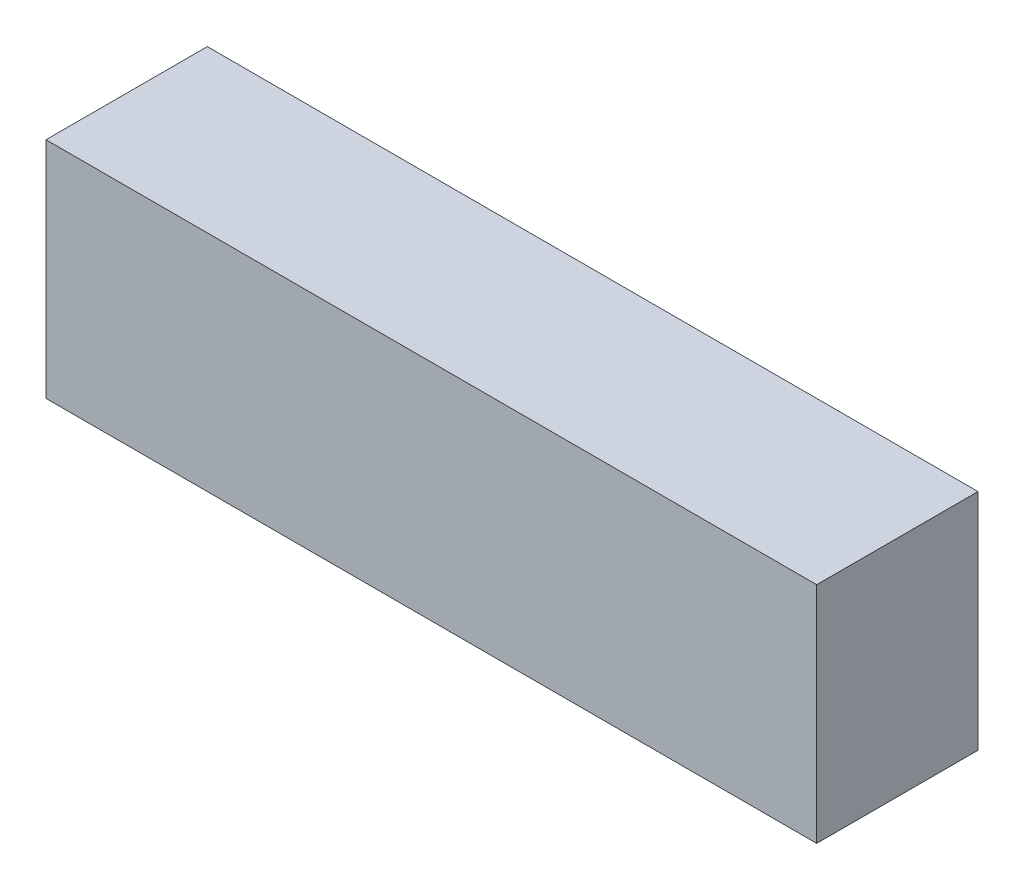
ISO-10303-21;
HEADER;
FILE_DESCRIPTION(('STEP AP214'),'2;1');
FILE_NAME('part.step','',(''),(''),'','','');
FILE_SCHEMA(('AUTOMOTIVE_DESIGN { 1 0 10303 214 1 1 1 1 }'));
ENDSEC;
DATA;
#1=APPLICATION_CONTEXT('core data for automotive mechanical design processes');
#2=APPLICATION_PROTOCOL_DEFINITION('international standard','automotive_design',2000,#1);
#3=PRODUCT_CONTEXT('',#1,'mechanical');
#4=PRODUCT('Part','Part','',(#3));
#5=PRODUCT_RELATED_PRODUCT_CATEGORY('part','',(#4));
#6=PRODUCT_DEFINITION_FORMATION('','',#4);
#7=PRODUCT_DEFINITION_CONTEXT('part definition',#1,'design');
#8=PRODUCT_DEFINITION('design','',#6,#7);
#9=PRODUCT_DEFINITION_SHAPE('','',#8);
#10=(LENGTH_UNIT() NAMED_UNIT(*) SI_UNIT(.MILLI.,.METRE.));
#11=(NAMED_UNIT(*) PLANE_ANGLE_UNIT() SI_UNIT($,.RADIAN.));
#12=(NAMED_UNIT(*) SI_UNIT($,.STERADIAN.) SOLID_ANGLE_UNIT());
#13=UNCERTAINTY_MEASURE_WITH_UNIT(LENGTH_MEASURE(1.E-05),#10,'distance_accuracy_value','');
#14=(GEOMETRIC_REPRESENTATION_CONTEXT(3) GLOBAL_UNCERTAINTY_ASSIGNED_CONTEXT((#13)) GLOBAL_UNIT_ASSIGNED_CONTEXT((#10,
#11,#12)) REPRESENTATION_CONTEXT('',''));
#15=CARTESIAN_POINT('',(0.,0.,0.));
#16=DIRECTION('',(0.,0.,1.));
#17=DIRECTION('',(1.,0.,0.));
#18=AXIS2_PLACEMENT_3D('',#15,#16,#17);
#19=CARTESIAN_POINT('',(21.5,6.25,9.));
#20=DIRECTION('',(1.,0.,0.));
#21=DIRECTION('',(0.,0.,-1.));
#22=AXIS2_PLACEMENT_3D('',#19,#20,#21);
#23=PLANE('',#22);
#24=DIRECTION('',(0.,-1.,0.));
#25=VECTOR('',#24,1.);
#26=CARTESIAN_POINT('',(21.5,6.25,0.));
#27=LINE('',#26,#25);
#28=CARTESIAN_POINT('',(21.5,6.25,0.));
#29=VERTEX_POINT('',#28);
#30=CARTESIAN_POINT('',(21.5,-6.25,0.));
#31=VERTEX_POINT('',#30);
#32=EDGE_CURVE('E100',#29,#31,#27,.T.);
#33=ORIENTED_EDGE('',*,*,#32,.F.);
#34=DIRECTION('',(0.,0.,-1.));
#35=VECTOR('',#34,1.);
#36=CARTESIAN_POINT('',(21.5,6.25,9.));
#37=LINE('',#36,#35);
#38=CARTESIAN_POINT('',(21.5,6.25,9.));
#39=VERTEX_POINT('',#38);
#40=EDGE_CURVE('E11',#39,#29,#37,.T.);
#41=ORIENTED_EDGE('',*,*,#40,.F.);
#42=DIRECTION('',(0.,-1.,0.));
#43=VECTOR('',#42,1.);
#44=CARTESIAN_POINT('',(21.5,6.25,9.));
#45=LINE('',#44,#43);
#46=CARTESIAN_POINT('',(21.5,-6.25,9.));
#47=VERTEX_POINT('',#46);
#48=EDGE_CURVE('E95',#39,#47,#45,.T.);
#49=ORIENTED_EDGE('',*,*,#48,.T.);
#50=DIRECTION('',(0.,0.,-1.));
#51=VECTOR('',#50,1.);
#52=CARTESIAN_POINT('',(21.5,-6.25,9.));
#53=LINE('',#52,#51);
#54=EDGE_CURVE('E38',#47,#31,#53,.T.);
#55=ORIENTED_EDGE('',*,*,#54,.T.);
#56=EDGE_LOOP('',(#33,#41,#49,#55));
#57=FACE_BOUND('',#56,.T.);
#58=ADVANCED_FACE('F35',(#57),#23,.T.);
#59=CARTESIAN_POINT('',(21.5,6.25,9.));
#60=DIRECTION('',(0.,-1.,0.));
#61=DIRECTION('',(1.,0.,0.));
#62=AXIS2_PLACEMENT_3D('',#59,#60,#61);
#63=PLANE('',#62);
#64=DIRECTION('',(-1.,0.,0.));
#65=VECTOR('',#64,1.);
#66=CARTESIAN_POINT('',(21.5,6.25,0.));
#67=LINE('',#66,#65);
#68=CARTESIAN_POINT('',(-21.5,6.25,0.));
#69=VERTEX_POINT('',#68);
#70=EDGE_CURVE('E68',#29,#69,#67,.T.);
#71=ORIENTED_EDGE('',*,*,#70,.T.);
#72=DIRECTION('',(0.,0.,-1.));
#73=VECTOR('',#72,1.);
#74=CARTESIAN_POINT('',(-21.5,6.25,9.));
#75=LINE('',#74,#73);
#76=CARTESIAN_POINT('',(-21.5,6.25,9.));
#77=VERTEX_POINT('',#76);
#78=EDGE_CURVE('E44',#77,#69,#75,.T.);
#79=ORIENTED_EDGE('',*,*,#78,.F.);
#80=DIRECTION('',(-1.,0.,0.));
#81=VECTOR('',#80,1.);
#82=CARTESIAN_POINT('',(21.5,6.25,9.));
#83=LINE('',#82,#81);
#84=EDGE_CURVE('E85',#39,#77,#83,.T.);
#85=ORIENTED_EDGE('',*,*,#84,.F.);
#86=ORIENTED_EDGE('',*,*,#40,.T.);
#87=EDGE_LOOP('',(#71,#79,#85,#86));
#88=FACE_BOUND('',#87,.T.);
#89=ADVANCED_FACE('F110',(#88),#63,.F.);
#90=CARTESIAN_POINT('',(-21.5,6.25,9.));
#91=DIRECTION('',(1.,0.,0.));
#92=DIRECTION('',(0.,0.,-1.));
#93=AXIS2_PLACEMENT_3D('',#90,#91,#92);
#94=PLANE('',#93);
#95=DIRECTION('',(0.,-1.,0.));
#96=VECTOR('',#95,1.);
#97=CARTESIAN_POINT('',(-21.5,6.25,0.));
#98=LINE('',#97,#96);
#99=CARTESIAN_POINT('',(-21.5,-6.25,0.));
#100=VERTEX_POINT('',#99);
#101=EDGE_CURVE('E92',#69,#100,#98,.T.);
#102=ORIENTED_EDGE('',*,*,#101,.T.);
#103=DIRECTION('',(0.,0.,-1.));
#104=VECTOR('',#103,1.);
#105=CARTESIAN_POINT('',(-21.5,-6.25,9.));
#106=LINE('',#105,#104);
#107=CARTESIAN_POINT('',(-21.5,-6.25,9.));
#108=VERTEX_POINT('',#107);
#109=EDGE_CURVE('E89',#108,#100,#106,.T.);
#110=ORIENTED_EDGE('',*,*,#109,.F.);
#111=DIRECTION('',(0.,-1.,0.));
#112=VECTOR('',#111,1.);
#113=CARTESIAN_POINT('',(-21.5,6.25,9.));
#114=LINE('',#113,#112);
#115=EDGE_CURVE('E80',#77,#108,#114,.T.);
#116=ORIENTED_EDGE('',*,*,#115,.F.);
#117=ORIENTED_EDGE('',*,*,#78,.T.);
#118=EDGE_LOOP('',(#102,#110,#116,#117));
#119=FACE_BOUND('',#118,.T.);
#120=ADVANCED_FACE('F90',(#119),#94,.F.);
#121=CARTESIAN_POINT('',(21.5,-6.25,9.));
#122=DIRECTION('',(0.,-1.,0.));
#123=DIRECTION('',(1.,0.,0.));
#124=AXIS2_PLACEMENT_3D('',#121,#122,#123);
#125=PLANE('',#124);
#126=DIRECTION('',(-1.,0.,0.));
#127=VECTOR('',#126,1.);
#128=CARTESIAN_POINT('',(21.5,-6.25,0.));
#129=LINE('',#128,#127);
#130=EDGE_CURVE('E103',#31,#100,#129,.T.);
#131=ORIENTED_EDGE('',*,*,#130,.F.);
#132=ORIENTED_EDGE('',*,*,#54,.F.);
#133=DIRECTION('',(-1.,0.,0.));
#134=VECTOR('',#133,1.);
#135=CARTESIAN_POINT('',(21.5,-6.25,9.));
#136=LINE('',#135,#134);
#137=EDGE_CURVE('E84',#47,#108,#136,.T.);
#138=ORIENTED_EDGE('',*,*,#137,.T.);
#139=ORIENTED_EDGE('',*,*,#109,.T.);
#140=EDGE_LOOP('',(#131,#132,#138,#139));
#141=FACE_BOUND('',#140,.T.);
#142=ADVANCED_FACE('F94',(#141),#125,.T.);
#143=CARTESIAN_POINT('',(0.,0.,9.));
#144=DIRECTION('',(0.,0.,-1.));
#145=DIRECTION('',(-1.,0.,0.));
#146=AXIS2_PLACEMENT_3D('',#143,#144,#145);
#147=PLANE('',#146);
#148=ORIENTED_EDGE('',*,*,#48,.F.);
#149=ORIENTED_EDGE('',*,*,#84,.T.);
#150=ORIENTED_EDGE('',*,*,#115,.T.);
#151=ORIENTED_EDGE('',*,*,#137,.F.);
#152=EDGE_LOOP('',(#148,#149,#150,#151));
#153=FACE_BOUND('',#152,.T.);
#154=ADVANCED_FACE('F83',(#153),#147,.F.);
#155=CARTESIAN_POINT('',(0.,0.,0.));
#156=DIRECTION('',(0.,0.,-1.));
#157=DIRECTION('',(-1.,0.,0.));
#158=AXIS2_PLACEMENT_3D('',#155,#156,#157);
#159=PLANE('',#158);
#160=ORIENTED_EDGE('',*,*,#32,.T.);
#161=ORIENTED_EDGE('',*,*,#130,.T.);
#162=ORIENTED_EDGE('',*,*,#101,.F.);
#163=ORIENTED_EDGE('',*,*,#70,.F.);
#164=EDGE_LOOP('',(#160,#161,#162,#163));
#165=FACE_BOUND('',#164,.T.);
#166=ADVANCED_FACE('F108',(#165),#159,.T.);
#167=CLOSED_SHELL('',(#58,#89,#120,#142,#154,#166));
#168=MANIFOLD_SOLID_BREP('B2',#167);
#169=ADVANCED_BREP_SHAPE_REPRESENTATION('',(#18,#168),#14);
#170=SHAPE_DEFINITION_REPRESENTATION(#9,#169);
ENDSEC;
END-ISO-10303-21;
